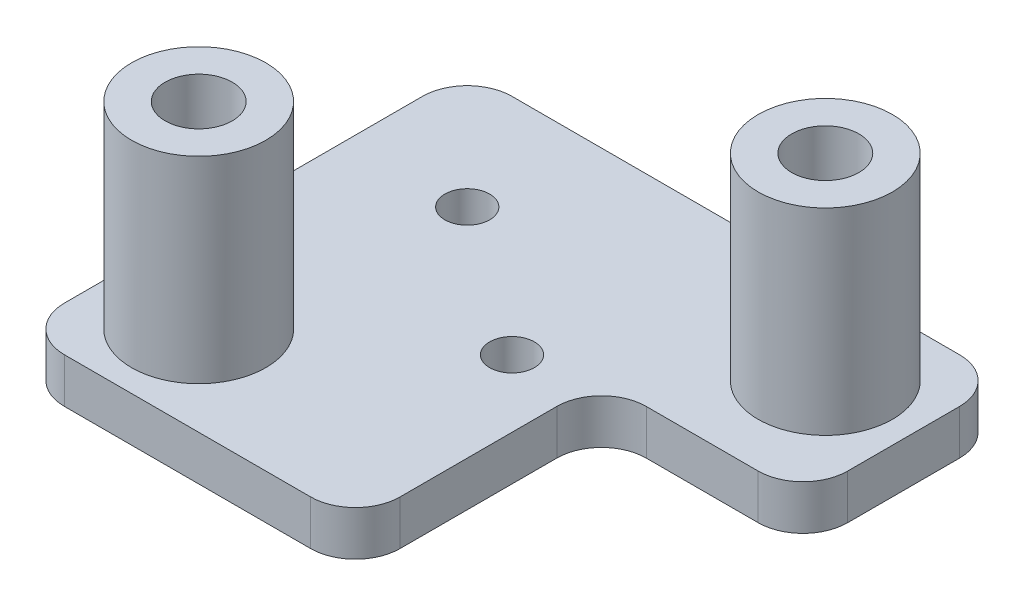
ISO-10303-21;
HEADER;
FILE_DESCRIPTION(('STEP AP214'),'2;1');
FILE_NAME('part.step','',(''),(''),'','','');
FILE_SCHEMA(('AUTOMOTIVE_DESIGN { 1 0 10303 214 1 1 1 1 }'));
ENDSEC;
DATA;
#1=APPLICATION_CONTEXT('core data for automotive mechanical design processes');
#2=APPLICATION_PROTOCOL_DEFINITION('international standard','automotive_design',2000,#1);
#3=PRODUCT_CONTEXT('',#1,'mechanical');
#4=PRODUCT('Part','Part','',(#3));
#5=PRODUCT_RELATED_PRODUCT_CATEGORY('part','',(#4));
#6=PRODUCT_DEFINITION_FORMATION('','',#4);
#7=PRODUCT_DEFINITION_CONTEXT('part definition',#1,'design');
#8=PRODUCT_DEFINITION('design','',#6,#7);
#9=PRODUCT_DEFINITION_SHAPE('','',#8);
#10=(LENGTH_UNIT() NAMED_UNIT(*) SI_UNIT(.MILLI.,.METRE.));
#11=(NAMED_UNIT(*) PLANE_ANGLE_UNIT() SI_UNIT($,.RADIAN.));
#12=(NAMED_UNIT(*) SI_UNIT($,.STERADIAN.) SOLID_ANGLE_UNIT());
#13=UNCERTAINTY_MEASURE_WITH_UNIT(LENGTH_MEASURE(1.E-05),#10,'distance_accuracy_value','');
#14=(GEOMETRIC_REPRESENTATION_CONTEXT(3) GLOBAL_UNCERTAINTY_ASSIGNED_CONTEXT((#13)) GLOBAL_UNIT_ASSIGNED_CONTEXT((#10,
#11,#12)) REPRESENTATION_CONTEXT('',''));
#15=CARTESIAN_POINT('',(0.,0.,0.));
#16=DIRECTION('',(0.,0.,1.));
#17=DIRECTION('',(1.,0.,0.));
#18=AXIS2_PLACEMENT_3D('',#15,#16,#17);
#19=CARTESIAN_POINT('',(-4.,5.4,3.));
#20=DIRECTION('',(0.,-1.,0.));
#21=DIRECTION('',(0.,0.,-1.));
#22=AXIS2_PLACEMENT_3D('',#19,#20,#21);
#23=CYLINDRICAL_SURFACE('',#22,1.5);
#24=CARTESIAN_POINT('',(-4.,5.4,3.));
#25=DIRECTION('',(0.,1.,0.));
#26=DIRECTION('',(0.,0.,1.));
#27=AXIS2_PLACEMENT_3D('',#24,#25,#26);
#28=CIRCLE('',#27,1.5);
#29=CARTESIAN_POINT('',(-4.,5.4,4.5));
#30=VERTEX_POINT('',#29);
#31=EDGE_CURVE('E11',#30,#30,#28,.T.);
#32=ORIENTED_EDGE('',*,*,#31,.F.);
#33=EDGE_LOOP('',(#32));
#34=FACE_BOUND('',#33,.T.);
#35=CARTESIAN_POINT('',(-4.,0.,3.));
#36=DIRECTION('',(0.,-1.,0.));
#37=DIRECTION('',(0.,0.,-1.));
#38=AXIS2_PLACEMENT_3D('',#35,#36,#37);
#39=CIRCLE('',#38,1.5);
#40=CARTESIAN_POINT('',(-4.,0.,1.5));
#41=VERTEX_POINT('',#40);
#42=EDGE_CURVE('E57',#41,#41,#39,.T.);
#43=ORIENTED_EDGE('',*,*,#42,.F.);
#44=EDGE_LOOP('',(#43));
#45=FACE_BOUND('',#44,.T.);
#46=ADVANCED_FACE('F47',(#34,#45),#23,.T.);
#47=CARTESIAN_POINT('',(-4.,5.4,3.));
#48=DIRECTION('',(0.,1.,0.));
#49=DIRECTION('',(0.,0.,1.));
#50=AXIS2_PLACEMENT_3D('',#47,#48,#49);
#51=PLANE('',#50);
#52=CARTESIAN_POINT('',(-4.,5.4,3.));
#53=DIRECTION('',(0.,1.,0.));
#54=DIRECTION('',(0.,0.,1.));
#55=AXIS2_PLACEMENT_3D('',#52,#53,#54);
#56=CIRCLE('',#55,0.75);
#57=CARTESIAN_POINT('',(-4.,5.4,3.75));
#58=VERTEX_POINT('',#57);
#59=EDGE_CURVE('E53',#58,#58,#56,.T.);
#60=ORIENTED_EDGE('',*,*,#59,.F.);
#61=EDGE_LOOP('',(#60));
#62=FACE_BOUND('',#61,.T.);
#63=ORIENTED_EDGE('',*,*,#31,.T.);
#64=EDGE_LOOP('',(#63));
#65=FACE_BOUND('',#64,.T.);
#66=ADVANCED_FACE('F76',(#62,#65),#51,.T.);
#67=CARTESIAN_POINT('',(-4.,-2.6,3.));
#68=DIRECTION('',(0.,1.,0.));
#69=DIRECTION('',(0.,0.,1.));
#70=AXIS2_PLACEMENT_3D('',#67,#68,#69);
#71=CYLINDRICAL_SURFACE('',#70,0.75);
#72=ORIENTED_EDGE('',*,*,#59,.T.);
#73=EDGE_LOOP('',(#72));
#74=FACE_BOUND('',#73,.T.);
#75=CARTESIAN_POINT('',(-4.,0.,3.));
#76=DIRECTION('',(0.,-1.,0.));
#77=DIRECTION('',(0.,0.,-1.));
#78=AXIS2_PLACEMENT_3D('',#75,#76,#77);
#79=CIRCLE('',#78,0.75);
#80=CARTESIAN_POINT('',(-4.,0.,2.25));
#81=VERTEX_POINT('',#80);
#82=EDGE_CURVE('E61',#81,#81,#79,.T.);
#83=ORIENTED_EDGE('',*,*,#82,.T.);
#84=EDGE_LOOP('',(#83));
#85=FACE_BOUND('',#84,.T.);
#86=ADVANCED_FACE('F67',(#74,#85),#71,.F.);
#87=CARTESIAN_POINT('',(-4.,0.,3.));
#88=DIRECTION('',(0.,-1.,0.));
#89=DIRECTION('',(0.,0.,-1.));
#90=AXIS2_PLACEMENT_3D('',#87,#88,#89);
#91=PLANE('',#90);
#92=ORIENTED_EDGE('',*,*,#42,.T.);
#93=EDGE_LOOP('',(#92));
#94=FACE_BOUND('',#93,.T.);
#95=ORIENTED_EDGE('',*,*,#82,.F.);
#96=EDGE_LOOP('',(#95));
#97=FACE_BOUND('',#96,.T.);
#98=ADVANCED_FACE('F69',(#94,#97),#91,.T.);
#99=CLOSED_SHELL('',(#46,#66,#86,#98));
#100=MANIFOLD_SOLID_BREP('B2',#99);
#101=CARTESIAN_POINT('',(4.,5.4,-3.));
#102=DIRECTION('',(0.,-1.,0.));
#103=DIRECTION('',(0.,0.,-1.));
#104=AXIS2_PLACEMENT_3D('',#101,#102,#103);
#105=CYLINDRICAL_SURFACE('',#104,1.5);
#106=CARTESIAN_POINT('',(4.,5.4,-3.));
#107=DIRECTION('',(0.,1.,0.));
#108=DIRECTION('',(0.,0.,1.));
#109=AXIS2_PLACEMENT_3D('',#106,#107,#108);
#110=CIRCLE('',#109,1.5);
#111=CARTESIAN_POINT('',(4.,5.4,-1.5));
#112=VERTEX_POINT('',#111);
#113=EDGE_CURVE('E46',#112,#112,#110,.T.);
#114=ORIENTED_EDGE('',*,*,#113,.F.);
#115=EDGE_LOOP('',(#114));
#116=FACE_BOUND('',#115,.T.);
#117=CARTESIAN_POINT('',(4.,0.,-3.));
#118=DIRECTION('',(0.,-1.,0.));
#119=DIRECTION('',(0.,0.,-1.));
#120=AXIS2_PLACEMENT_3D('',#117,#118,#119);
#121=CIRCLE('',#120,1.5);
#122=CARTESIAN_POINT('',(4.,0.,-4.5));
#123=VERTEX_POINT('',#122);
#124=EDGE_CURVE('E133',#123,#123,#121,.T.);
#125=ORIENTED_EDGE('',*,*,#124,.F.);
#126=EDGE_LOOP('',(#125));
#127=FACE_BOUND('',#126,.T.);
#128=ADVANCED_FACE('F123',(#116,#127),#105,.T.);
#129=CARTESIAN_POINT('',(4.,5.4,-3.));
#130=DIRECTION('',(0.,1.,0.));
#131=DIRECTION('',(0.,0.,1.));
#132=AXIS2_PLACEMENT_3D('',#129,#130,#131);
#133=PLANE('',#132);
#134=CARTESIAN_POINT('',(4.,5.4,-3.));
#135=DIRECTION('',(0.,1.,0.));
#136=DIRECTION('',(0.,0.,1.));
#137=AXIS2_PLACEMENT_3D('',#134,#135,#136);
#138=CIRCLE('',#137,0.75);
#139=CARTESIAN_POINT('',(4.,5.4,-2.25));
#140=VERTEX_POINT('',#139);
#141=EDGE_CURVE('E129',#140,#140,#138,.T.);
#142=ORIENTED_EDGE('',*,*,#141,.F.);
#143=EDGE_LOOP('',(#142));
#144=FACE_BOUND('',#143,.T.);
#145=ORIENTED_EDGE('',*,*,#113,.T.);
#146=EDGE_LOOP('',(#145));
#147=FACE_BOUND('',#146,.T.);
#148=ADVANCED_FACE('F152',(#144,#147),#133,.T.);
#149=CARTESIAN_POINT('',(4.,-2.6,-3.));
#150=DIRECTION('',(0.,1.,0.));
#151=DIRECTION('',(0.,0.,1.));
#152=AXIS2_PLACEMENT_3D('',#149,#150,#151);
#153=CYLINDRICAL_SURFACE('',#152,0.75);
#154=ORIENTED_EDGE('',*,*,#141,.T.);
#155=EDGE_LOOP('',(#154));
#156=FACE_BOUND('',#155,.T.);
#157=CARTESIAN_POINT('',(4.,0.,-3.));
#158=DIRECTION('',(0.,-1.,0.));
#159=DIRECTION('',(0.,0.,-1.));
#160=AXIS2_PLACEMENT_3D('',#157,#158,#159);
#161=CIRCLE('',#160,0.75);
#162=CARTESIAN_POINT('',(4.,0.,-3.75));
#163=VERTEX_POINT('',#162);
#164=EDGE_CURVE('E137',#163,#163,#161,.T.);
#165=ORIENTED_EDGE('',*,*,#164,.T.);
#166=EDGE_LOOP('',(#165));
#167=FACE_BOUND('',#166,.T.);
#168=ADVANCED_FACE('F143',(#156,#167),#153,.F.);
#169=CARTESIAN_POINT('',(4.,0.,-3.));
#170=DIRECTION('',(0.,-1.,0.));
#171=DIRECTION('',(0.,0.,-1.));
#172=AXIS2_PLACEMENT_3D('',#169,#170,#171);
#173=PLANE('',#172);
#174=ORIENTED_EDGE('',*,*,#124,.T.);
#175=EDGE_LOOP('',(#174));
#176=FACE_BOUND('',#175,.T.);
#177=ORIENTED_EDGE('',*,*,#164,.F.);
#178=EDGE_LOOP('',(#177));
#179=FACE_BOUND('',#178,.T.);
#180=ADVANCED_FACE('F145',(#176,#179),#173,.T.);
#181=CLOSED_SHELL('',(#128,#148,#168,#180));
#182=MANIFOLD_SOLID_BREP('B6',#181);
#183=CARTESIAN_POINT('',(0.,1.,0.));
#184=DIRECTION('',(0.,1.,0.));
#185=DIRECTION('',(0.,0.,1.));
#186=AXIS2_PLACEMENT_3D('',#183,#184,#185);
#187=PLANE('',#186);
#188=CARTESIAN_POINT('',(-3.36,1.,-2.36));
#189=DIRECTION('',(0.,1.,0.));
#190=DIRECTION('',(0.,0.,1.));
#191=AXIS2_PLACEMENT_3D('',#188,#189,#190);
#192=CIRCLE('',#191,0.5);
#193=CARTESIAN_POINT('',(-3.36,1.,-1.86));
#194=VERTEX_POINT('',#193);
#195=EDGE_CURVE('E490',#194,#194,#192,.T.);
#196=ORIENTED_EDGE('',*,*,#195,.F.);
#197=EDGE_LOOP('',(#196));
#198=FACE_BOUND('',#197,.T.);
#199=CARTESIAN_POINT('',(0.,1.,0.));
#200=DIRECTION('',(0.,1.,0.));
#201=DIRECTION('',(0.,0.,1.));
#202=AXIS2_PLACEMENT_3D('',#199,#200,#201);
#203=CIRCLE('',#202,0.5);
#204=CARTESIAN_POINT('',(0.,1.,0.5));
#205=VERTEX_POINT('',#204);
#206=EDGE_CURVE('E499',#205,#205,#203,.T.);
#207=ORIENTED_EDGE('',*,*,#206,.F.);
#208=EDGE_LOOP('',(#207));
#209=FACE_BOUND('',#208,.T.);
#210=CARTESIAN_POINT('',(4.,1.,-3.));
#211=DIRECTION('',(0.,1.,0.));
#212=DIRECTION('',(0.,0.,1.));
#213=AXIS2_PLACEMENT_3D('',#210,#211,#212);
#214=CIRCLE('',#213,1.5);
#215=CARTESIAN_POINT('',(4.,1.,-1.5));
#216=VERTEX_POINT('',#215);
#217=EDGE_CURVE('E388',#216,#216,#214,.T.);
#218=ORIENTED_EDGE('',*,*,#217,.F.);
#219=EDGE_LOOP('',(#218));
#220=FACE_BOUND('',#219,.T.);
#221=DIRECTION('',(1.,0.,0.));
#222=VECTOR('',#221,1.);
#223=CARTESIAN_POINT('',(1.5,1.,-0.500000000000002));
#224=LINE('',#223,#222);
#225=CARTESIAN_POINT('',(2.5,1.,-0.500000000000002));
#226=VERTEX_POINT('',#225);
#227=CARTESIAN_POINT('',(5.,1.,-0.500000000000002));
#228=VERTEX_POINT('',#227);
#229=EDGE_CURVE('E297',#226,#228,#224,.T.);
#230=ORIENTED_EDGE('',*,*,#229,.T.);
#231=CARTESIAN_POINT('',(5.,1.,-1.5));
#232=DIRECTION('',(0.,1.,0.));
#233=DIRECTION('',(0.,0.,1.));
#234=AXIS2_PLACEMENT_3D('',#231,#232,#233);
#235=CIRCLE('',#234,1.);
#236=CARTESIAN_POINT('',(6.,1.,-1.5));
#237=VERTEX_POINT('',#236);
#238=EDGE_CURVE('E343',#228,#237,#235,.T.);
#239=ORIENTED_EDGE('',*,*,#238,.T.);
#240=DIRECTION('',(0.,0.,-1.));
#241=VECTOR('',#240,1.);
#242=CARTESIAN_POINT('',(6.,1.,-5.));
#243=LINE('',#242,#241);
#244=CARTESIAN_POINT('',(6.,1.,-4.));
#245=VERTEX_POINT('',#244);
#246=EDGE_CURVE('E385',#237,#245,#243,.T.);
#247=ORIENTED_EDGE('',*,*,#246,.T.);
#248=CARTESIAN_POINT('',(5.,1.,-4.));
#249=DIRECTION('',(0.,1.,0.));
#250=DIRECTION('',(0.,0.,1.));
#251=AXIS2_PLACEMENT_3D('',#248,#249,#250);
#252=CIRCLE('',#251,1.);
#253=CARTESIAN_POINT('',(5.,1.,-5.));
#254=VERTEX_POINT('',#253);
#255=EDGE_CURVE('E212',#245,#254,#252,.T.);
#256=ORIENTED_EDGE('',*,*,#255,.T.);
#257=DIRECTION('',(-1.,0.,0.));
#258=VECTOR('',#257,1.);
#259=CARTESIAN_POINT('',(-6.,1.,-5.));
#260=LINE('',#259,#258);
#261=CARTESIAN_POINT('',(-5.,1.,-5.));
#262=VERTEX_POINT('',#261);
#263=EDGE_CURVE('E317',#254,#262,#260,.T.);
#264=ORIENTED_EDGE('',*,*,#263,.T.);
#265=CARTESIAN_POINT('',(-5.,1.,-4.));
#266=DIRECTION('',(0.,1.,0.));
#267=DIRECTION('',(0.,0.,1.));
#268=AXIS2_PLACEMENT_3D('',#265,#266,#267);
#269=CIRCLE('',#268,1.);
#270=CARTESIAN_POINT('',(-6.,1.,-4.));
#271=VERTEX_POINT('',#270);
#272=EDGE_CURVE('E336',#262,#271,#269,.T.);
#273=ORIENTED_EDGE('',*,*,#272,.T.);
#274=DIRECTION('',(0.,0.,1.));
#275=VECTOR('',#274,1.);
#276=CARTESIAN_POINT('',(-6.,1.,-5.));
#277=LINE('',#276,#275);
#278=CARTESIAN_POINT('',(-6.,1.,4.));
#279=VERTEX_POINT('',#278);
#280=EDGE_CURVE('E316',#271,#279,#277,.T.);
#281=ORIENTED_EDGE('',*,*,#280,.T.);
#282=CARTESIAN_POINT('',(-5.,1.,4.));
#283=DIRECTION('',(0.,1.,0.));
#284=DIRECTION('',(0.,0.,1.));
#285=AXIS2_PLACEMENT_3D('',#282,#283,#284);
#286=CIRCLE('',#285,1.);
#287=CARTESIAN_POINT('',(-5.,1.,5.));
#288=VERTEX_POINT('',#287);
#289=EDGE_CURVE('E339',#279,#288,#286,.T.);
#290=ORIENTED_EDGE('',*,*,#289,.T.);
#291=DIRECTION('',(1.,0.,0.));
#292=VECTOR('',#291,1.);
#293=CARTESIAN_POINT('',(-6.,1.,5.));
#294=LINE('',#293,#292);
#295=CARTESIAN_POINT('',(0.5,1.,5.));
#296=VERTEX_POINT('',#295);
#297=EDGE_CURVE('E373',#288,#296,#294,.T.);
#298=ORIENTED_EDGE('',*,*,#297,.T.);
#299=CARTESIAN_POINT('',(0.499999999999999,1.,4.));
#300=DIRECTION('',(0.,1.,0.));
#301=DIRECTION('',(0.,0.,1.));
#302=AXIS2_PLACEMENT_3D('',#299,#300,#301);
#303=CIRCLE('',#302,1.);
#304=CARTESIAN_POINT('',(1.5,1.,4.));
#305=VERTEX_POINT('',#304);
#306=EDGE_CURVE('E341',#296,#305,#303,.T.);
#307=ORIENTED_EDGE('',*,*,#306,.T.);
#308=DIRECTION('',(0.,0.,-1.));
#309=VECTOR('',#308,1.);
#310=CARTESIAN_POINT('',(1.5,1.,5.));
#311=LINE('',#310,#309);
#312=CARTESIAN_POINT('',(1.5,1.,0.499999999999998));
#313=VERTEX_POINT('',#312);
#314=EDGE_CURVE('E376',#305,#313,#311,.T.);
#315=ORIENTED_EDGE('',*,*,#314,.T.);
#316=CARTESIAN_POINT('',(2.5,1.,0.499999999999998));
#317=DIRECTION('',(0.,1.,0.));
#318=DIRECTION('',(0.,0.,1.));
#319=AXIS2_PLACEMENT_3D('',#316,#317,#318);
#320=CIRCLE('',#319,1.);
#321=EDGE_CURVE('E121',#313,#226,#320,.F.);
#322=ORIENTED_EDGE('',*,*,#321,.T.);
#323=EDGE_LOOP('',(#230,#239,#247,#256,#264,#273,#281,#290,#298,#307,#315,#322));
#324=FACE_BOUND('',#323,.T.);
#325=CARTESIAN_POINT('',(-4.,1.,3.));
#326=DIRECTION('',(0.,1.,0.));
#327=DIRECTION('',(0.,0.,1.));
#328=AXIS2_PLACEMENT_3D('',#325,#326,#327);
#329=CIRCLE('',#328,1.5);
#330=CARTESIAN_POINT('',(-4.,1.,4.5));
#331=VERTEX_POINT('',#330);
#332=EDGE_CURVE('E481',#331,#331,#329,.T.);
#333=ORIENTED_EDGE('',*,*,#332,.F.);
#334=EDGE_LOOP('',(#333));
#335=FACE_BOUND('',#334,.T.);
#336=ADVANCED_FACE('F190',(#198,#209,#220,#324,#335),#187,.T.);
#337=CARTESIAN_POINT('',(0.,0.,0.));
#338=DIRECTION('',(0.,1.,0.));
#339=DIRECTION('',(0.,0.,1.));
#340=AXIS2_PLACEMENT_3D('',#337,#338,#339);
#341=PLANE('',#340);
#342=CARTESIAN_POINT('',(-3.36,0.,-2.36));
#343=DIRECTION('',(0.,1.,0.));
#344=DIRECTION('',(0.,0.,1.));
#345=AXIS2_PLACEMENT_3D('',#342,#343,#344);
#346=CIRCLE('',#345,0.5);
#347=CARTESIAN_POINT('',(-3.36,0.,-1.86));
#348=VERTEX_POINT('',#347);
#349=EDGE_CURVE('E486',#348,#348,#346,.T.);
#350=ORIENTED_EDGE('',*,*,#349,.T.);
#351=EDGE_LOOP('',(#350));
#352=FACE_BOUND('',#351,.T.);
#353=CARTESIAN_POINT('',(0.,0.,0.));
#354=DIRECTION('',(0.,1.,0.));
#355=DIRECTION('',(0.,0.,1.));
#356=AXIS2_PLACEMENT_3D('',#353,#354,#355);
#357=CIRCLE('',#356,0.5);
#358=CARTESIAN_POINT('',(0.,0.,0.5));
#359=VERTEX_POINT('',#358);
#360=EDGE_CURVE('E502',#359,#359,#357,.T.);
#361=ORIENTED_EDGE('',*,*,#360,.T.);
#362=EDGE_LOOP('',(#361));
#363=FACE_BOUND('',#362,.T.);
#364=DIRECTION('',(0.,0.,-1.));
#365=VECTOR('',#364,1.);
#366=CARTESIAN_POINT('',(6.,0.,-5.));
#367=LINE('',#366,#365);
#368=CARTESIAN_POINT('',(6.,0.,-1.5));
#369=VERTEX_POINT('',#368);
#370=CARTESIAN_POINT('',(6.,0.,-4.));
#371=VERTEX_POINT('',#370);
#372=EDGE_CURVE('E305',#369,#371,#367,.T.);
#373=ORIENTED_EDGE('',*,*,#372,.F.);
#374=CARTESIAN_POINT('',(5.,0.,-1.5));
#375=DIRECTION('',(0.,1.,0.));
#376=DIRECTION('',(0.,0.,1.));
#377=AXIS2_PLACEMENT_3D('',#374,#375,#376);
#378=CIRCLE('',#377,1.);
#379=CARTESIAN_POINT('',(5.,0.,-0.500000000000002));
#380=VERTEX_POINT('',#379);
#381=EDGE_CURVE('E304',#369,#380,#378,.F.);
#382=ORIENTED_EDGE('',*,*,#381,.T.);
#383=DIRECTION('',(1.,0.,0.));
#384=VECTOR('',#383,1.);
#385=CARTESIAN_POINT('',(1.5,0.,-0.500000000000002));
#386=LINE('',#385,#384);
#387=CARTESIAN_POINT('',(2.5,0.,-0.500000000000002));
#388=VERTEX_POINT('',#387);
#389=EDGE_CURVE('E294',#388,#380,#386,.T.);
#390=ORIENTED_EDGE('',*,*,#389,.F.);
#391=CARTESIAN_POINT('',(2.5,0.,0.499999999999998));
#392=DIRECTION('',(0.,1.,0.));
#393=DIRECTION('',(0.,0.,1.));
#394=AXIS2_PLACEMENT_3D('',#391,#392,#393);
#395=CIRCLE('',#394,1.);
#396=CARTESIAN_POINT('',(1.5,0.,0.499999999999998));
#397=VERTEX_POINT('',#396);
#398=EDGE_CURVE('E198',#388,#397,#395,.T.);
#399=ORIENTED_EDGE('',*,*,#398,.T.);
#400=DIRECTION('',(0.,0.,-1.));
#401=VECTOR('',#400,1.);
#402=CARTESIAN_POINT('',(1.5,0.,5.));
#403=LINE('',#402,#401);
#404=CARTESIAN_POINT('',(1.5,0.,4.));
#405=VERTEX_POINT('',#404);
#406=EDGE_CURVE('E306',#405,#397,#403,.T.);
#407=ORIENTED_EDGE('',*,*,#406,.F.);
#408=CARTESIAN_POINT('',(0.499999999999999,0.,4.));
#409=DIRECTION('',(0.,1.,0.));
#410=DIRECTION('',(0.,0.,1.));
#411=AXIS2_PLACEMENT_3D('',#408,#409,#410);
#412=CIRCLE('',#411,1.);
#413=CARTESIAN_POINT('',(0.5,0.,5.));
#414=VERTEX_POINT('',#413);
#415=EDGE_CURVE('E333',#405,#414,#412,.F.);
#416=ORIENTED_EDGE('',*,*,#415,.T.);
#417=DIRECTION('',(1.,0.,0.));
#418=VECTOR('',#417,1.);
#419=CARTESIAN_POINT('',(-6.,0.,5.));
#420=LINE('',#419,#418);
#421=CARTESIAN_POINT('',(-5.,0.,5.));
#422=VERTEX_POINT('',#421);
#423=EDGE_CURVE('E311',#422,#414,#420,.T.);
#424=ORIENTED_EDGE('',*,*,#423,.F.);
#425=CARTESIAN_POINT('',(-5.,0.,4.));
#426=DIRECTION('',(0.,1.,0.));
#427=DIRECTION('',(0.,0.,1.));
#428=AXIS2_PLACEMENT_3D('',#425,#426,#427);
#429=CIRCLE('',#428,1.);
#430=CARTESIAN_POINT('',(-6.,0.,4.));
#431=VERTEX_POINT('',#430);
#432=EDGE_CURVE('E331',#422,#431,#429,.F.);
#433=ORIENTED_EDGE('',*,*,#432,.T.);
#434=DIRECTION('',(0.,0.,1.));
#435=VECTOR('',#434,1.);
#436=CARTESIAN_POINT('',(-6.,0.,-5.));
#437=LINE('',#436,#435);
#438=CARTESIAN_POINT('',(-6.,0.,-4.));
#439=VERTEX_POINT('',#438);
#440=EDGE_CURVE('E363',#439,#431,#437,.T.);
#441=ORIENTED_EDGE('',*,*,#440,.F.);
#442=CARTESIAN_POINT('',(-5.,0.,-4.));
#443=DIRECTION('',(0.,1.,0.));
#444=DIRECTION('',(0.,0.,1.));
#445=AXIS2_PLACEMENT_3D('',#442,#443,#444);
#446=CIRCLE('',#445,1.);
#447=CARTESIAN_POINT('',(-5.,0.,-5.));
#448=VERTEX_POINT('',#447);
#449=EDGE_CURVE('E327',#439,#448,#446,.F.);
#450=ORIENTED_EDGE('',*,*,#449,.T.);
#451=DIRECTION('',(-1.,0.,0.));
#452=VECTOR('',#451,1.);
#453=CARTESIAN_POINT('',(-6.,0.,-5.));
#454=LINE('',#453,#452);
#455=CARTESIAN_POINT('',(5.,0.,-5.));
#456=VERTEX_POINT('',#455);
#457=EDGE_CURVE('E309',#456,#448,#454,.T.);
#458=ORIENTED_EDGE('',*,*,#457,.F.);
#459=CARTESIAN_POINT('',(5.,0.,-4.));
#460=DIRECTION('',(0.,1.,0.));
#461=DIRECTION('',(0.,0.,1.));
#462=AXIS2_PLACEMENT_3D('',#459,#460,#461);
#463=CIRCLE('',#462,1.);
#464=EDGE_CURVE('E329',#456,#371,#463,.F.);
#465=ORIENTED_EDGE('',*,*,#464,.T.);
#466=EDGE_LOOP('',(#373,#382,#390,#399,#407,#416,#424,#433,#441,#450,#458,#465));
#467=FACE_BOUND('',#466,.T.);
#468=CARTESIAN_POINT('',(4.,0.,-3.));
#469=DIRECTION('',(0.,1.,0.));
#470=DIRECTION('',(0.,0.,1.));
#471=AXIS2_PLACEMENT_3D('',#468,#469,#470);
#472=CIRCLE('',#471,1.5);
#473=CARTESIAN_POINT('',(4.,0.,-1.5));
#474=VERTEX_POINT('',#473);
#475=EDGE_CURVE('E379',#474,#474,#472,.T.);
#476=ORIENTED_EDGE('',*,*,#475,.T.);
#477=EDGE_LOOP('',(#476));
#478=FACE_BOUND('',#477,.T.);
#479=CARTESIAN_POINT('',(-4.,0.,3.));
#480=DIRECTION('',(0.,1.,0.));
#481=DIRECTION('',(0.,0.,1.));
#482=AXIS2_PLACEMENT_3D('',#479,#480,#481);
#483=CIRCLE('',#482,1.5);
#484=CARTESIAN_POINT('',(-4.,0.,4.5));
#485=VERTEX_POINT('',#484);
#486=EDGE_CURVE('E484',#485,#485,#483,.T.);
#487=ORIENTED_EDGE('',*,*,#486,.T.);
#488=EDGE_LOOP('',(#487));
#489=FACE_BOUND('',#488,.T.);
#490=ADVANCED_FACE('F302',(#352,#363,#467,#478,#489),#341,.F.);
#491=CARTESIAN_POINT('',(-6.,1.,-5.));
#492=DIRECTION('',(1.,0.,0.));
#493=DIRECTION('',(0.,0.,-1.));
#494=AXIS2_PLACEMENT_3D('',#491,#492,#493);
#495=PLANE('',#494);
#496=ORIENTED_EDGE('',*,*,#440,.T.);
#497=DIRECTION('',(0.,-1.,0.));
#498=VECTOR('',#497,1.);
#499=CARTESIAN_POINT('',(-6.,1.,4.));
#500=LINE('',#499,#498);
#501=EDGE_CURVE('E353',#431,#279,#500,.F.);
#502=ORIENTED_EDGE('',*,*,#501,.T.);
#503=ORIENTED_EDGE('',*,*,#280,.F.);
#504=DIRECTION('',(0.,-1.,0.));
#505=VECTOR('',#504,1.);
#506=CARTESIAN_POINT('',(-6.,1.,-4.));
#507=LINE('',#506,#505);
#508=EDGE_CURVE('E350',#271,#439,#507,.T.);
#509=ORIENTED_EDGE('',*,*,#508,.T.);
#510=EDGE_LOOP('',(#496,#502,#503,#509));
#511=FACE_BOUND('',#510,.T.);
#512=ADVANCED_FACE('F369',(#511),#495,.F.);
#513=CARTESIAN_POINT('',(-6.,1.,5.));
#514=DIRECTION('',(0.,0.,-1.));
#515=DIRECTION('',(-1.,0.,0.));
#516=AXIS2_PLACEMENT_3D('',#513,#514,#515);
#517=PLANE('',#516);
#518=ORIENTED_EDGE('',*,*,#423,.T.);
#519=DIRECTION('',(0.,-1.,0.));
#520=VECTOR('',#519,1.);
#521=CARTESIAN_POINT('',(0.5,1.,5.));
#522=LINE('',#521,#520);
#523=EDGE_CURVE('E348',#414,#296,#522,.F.);
#524=ORIENTED_EDGE('',*,*,#523,.T.);
#525=ORIENTED_EDGE('',*,*,#297,.F.);
#526=DIRECTION('',(0.,-1.,0.));
#527=VECTOR('',#526,1.);
#528=CARTESIAN_POINT('',(-5.,1.,5.));
#529=LINE('',#528,#527);
#530=EDGE_CURVE('E345',#288,#422,#529,.T.);
#531=ORIENTED_EDGE('',*,*,#530,.T.);
#532=EDGE_LOOP('',(#518,#524,#525,#531));
#533=FACE_BOUND('',#532,.T.);
#534=ADVANCED_FACE('F393',(#533),#517,.F.);
#535=CARTESIAN_POINT('',(1.5,1.,5.));
#536=DIRECTION('',(-1.,0.,0.));
#537=DIRECTION('',(0.,0.,1.));
#538=AXIS2_PLACEMENT_3D('',#535,#536,#537);
#539=PLANE('',#538);
#540=ORIENTED_EDGE('',*,*,#406,.T.);
#541=DIRECTION('',(0.,-1.,0.));
#542=VECTOR('',#541,1.);
#543=CARTESIAN_POINT('',(1.5,1.,0.499999999999998));
#544=LINE('',#543,#542);
#545=EDGE_CURVE('E284',#397,#313,#544,.F.);
#546=ORIENTED_EDGE('',*,*,#545,.T.);
#547=ORIENTED_EDGE('',*,*,#314,.F.);
#548=DIRECTION('',(0.,-1.,0.));
#549=VECTOR('',#548,1.);
#550=CARTESIAN_POINT('',(1.5,1.,4.));
#551=LINE('',#550,#549);
#552=EDGE_CURVE('E298',#305,#405,#551,.T.);
#553=ORIENTED_EDGE('',*,*,#552,.T.);
#554=EDGE_LOOP('',(#540,#546,#547,#553));
#555=FACE_BOUND('',#554,.T.);
#556=ADVANCED_FACE('F403',(#555),#539,.F.);
#557=CARTESIAN_POINT('',(1.5,1.,-0.500000000000002));
#558=DIRECTION('',(0.,0.,-1.));
#559=DIRECTION('',(-1.,0.,0.));
#560=AXIS2_PLACEMENT_3D('',#557,#558,#559);
#561=PLANE('',#560);
#562=ORIENTED_EDGE('',*,*,#229,.F.);
#563=DIRECTION('',(0.,-1.,0.));
#564=VECTOR('',#563,1.);
#565=CARTESIAN_POINT('',(2.5,0.,-0.500000000000002));
#566=LINE('',#565,#564);
#567=EDGE_CURVE('E283',#226,#388,#566,.T.);
#568=ORIENTED_EDGE('',*,*,#567,.T.);
#569=ORIENTED_EDGE('',*,*,#389,.T.);
#570=DIRECTION('',(0.,-1.,0.));
#571=VECTOR('',#570,1.);
#572=CARTESIAN_POINT('',(5.,1.,-0.500000000000002));
#573=LINE('',#572,#571);
#574=EDGE_CURVE('E299',#380,#228,#573,.F.);
#575=ORIENTED_EDGE('',*,*,#574,.T.);
#576=EDGE_LOOP('',(#562,#568,#569,#575));
#577=FACE_BOUND('',#576,.T.);
#578=ADVANCED_FACE('F293',(#577),#561,.F.);
#579=CARTESIAN_POINT('',(6.,1.,-5.));
#580=DIRECTION('',(-1.,0.,0.));
#581=DIRECTION('',(0.,0.,1.));
#582=AXIS2_PLACEMENT_3D('',#579,#580,#581);
#583=PLANE('',#582);
#584=ORIENTED_EDGE('',*,*,#246,.F.);
#585=DIRECTION('',(0.,-1.,0.));
#586=VECTOR('',#585,1.);
#587=CARTESIAN_POINT('',(6.,1.,-1.5));
#588=LINE('',#587,#586);
#589=EDGE_CURVE('E324',#237,#369,#588,.T.);
#590=ORIENTED_EDGE('',*,*,#589,.T.);
#591=ORIENTED_EDGE('',*,*,#372,.T.);
#592=DIRECTION('',(0.,-1.,0.));
#593=VECTOR('',#592,1.);
#594=CARTESIAN_POINT('',(6.,1.,-4.));
#595=LINE('',#594,#593);
#596=EDGE_CURVE('E322',#371,#245,#595,.F.);
#597=ORIENTED_EDGE('',*,*,#596,.T.);
#598=EDGE_LOOP('',(#584,#590,#591,#597));
#599=FACE_BOUND('',#598,.T.);
#600=ADVANCED_FACE('F410',(#599),#583,.F.);
#601=CARTESIAN_POINT('',(-6.,1.,-5.));
#602=DIRECTION('',(0.,0.,1.));
#603=DIRECTION('',(1.,0.,0.));
#604=AXIS2_PLACEMENT_3D('',#601,#602,#603);
#605=PLANE('',#604);
#606=ORIENTED_EDGE('',*,*,#263,.F.);
#607=DIRECTION('',(0.,-1.,0.));
#608=VECTOR('',#607,1.);
#609=CARTESIAN_POINT('',(5.,1.,-5.));
#610=LINE('',#609,#608);
#611=EDGE_CURVE('E289',#254,#456,#610,.T.);
#612=ORIENTED_EDGE('',*,*,#611,.T.);
#613=ORIENTED_EDGE('',*,*,#457,.T.);
#614=DIRECTION('',(0.,-1.,0.));
#615=VECTOR('',#614,1.);
#616=CARTESIAN_POINT('',(-5.,1.,-5.));
#617=LINE('',#616,#615);
#618=EDGE_CURVE('E205',#448,#262,#617,.F.);
#619=ORIENTED_EDGE('',*,*,#618,.T.);
#620=EDGE_LOOP('',(#606,#612,#613,#619));
#621=FACE_BOUND('',#620,.T.);
#622=ADVANCED_FACE('F359',(#621),#605,.F.);
#623=CARTESIAN_POINT('',(4.,1.,-3.));
#624=DIRECTION('',(0.,-1.,0.));
#625=DIRECTION('',(0.,0.,-1.));
#626=AXIS2_PLACEMENT_3D('',#623,#624,#625);
#627=CYLINDRICAL_SURFACE('',#626,1.5);
#628=ORIENTED_EDGE('',*,*,#217,.T.);
#629=EDGE_LOOP('',(#628));
#630=FACE_BOUND('',#629,.T.);
#631=ORIENTED_EDGE('',*,*,#475,.F.);
#632=EDGE_LOOP('',(#631));
#633=FACE_BOUND('',#632,.T.);
#634=ADVANCED_FACE('F424',(#630,#633),#627,.F.);
#635=CARTESIAN_POINT('',(-4.,1.,3.));
#636=DIRECTION('',(0.,-1.,0.));
#637=DIRECTION('',(0.,0.,-1.));
#638=AXIS2_PLACEMENT_3D('',#635,#636,#637);
#639=CYLINDRICAL_SURFACE('',#638,1.5);
#640=ORIENTED_EDGE('',*,*,#332,.T.);
#641=EDGE_LOOP('',(#640));
#642=FACE_BOUND('',#641,.T.);
#643=ORIENTED_EDGE('',*,*,#486,.F.);
#644=EDGE_LOOP('',(#643));
#645=FACE_BOUND('',#644,.T.);
#646=ADVANCED_FACE('F447',(#642,#645),#639,.F.);
#647=CARTESIAN_POINT('',(2.5,1.,0.499999999999998));
#648=DIRECTION('',(0.,1.,0.));
#649=DIRECTION('',(0.,0.,1.));
#650=AXIS2_PLACEMENT_3D('',#647,#648,#649);
#651=CYLINDRICAL_SURFACE('',#650,1.);
#652=ORIENTED_EDGE('',*,*,#321,.F.);
#653=ORIENTED_EDGE('',*,*,#545,.F.);
#654=ORIENTED_EDGE('',*,*,#398,.F.);
#655=ORIENTED_EDGE('',*,*,#567,.F.);
#656=EDGE_LOOP('',(#652,#653,#654,#655));
#657=FACE_BOUND('',#656,.T.);
#658=ADVANCED_FACE('F282',(#657),#651,.F.);
#659=CARTESIAN_POINT('',(5.,1.,-1.5));
#660=DIRECTION('',(0.,-1.,0.));
#661=DIRECTION('',(0.,0.,-1.));
#662=AXIS2_PLACEMENT_3D('',#659,#660,#661);
#663=CYLINDRICAL_SURFACE('',#662,1.);
#664=ORIENTED_EDGE('',*,*,#238,.F.);
#665=ORIENTED_EDGE('',*,*,#574,.F.);
#666=ORIENTED_EDGE('',*,*,#381,.F.);
#667=ORIENTED_EDGE('',*,*,#589,.F.);
#668=EDGE_LOOP('',(#664,#665,#666,#667));
#669=FACE_BOUND('',#668,.T.);
#670=ADVANCED_FACE('F438',(#669),#663,.T.);
#671=CARTESIAN_POINT('',(0.499999999999999,1.,4.));
#672=DIRECTION('',(0.,-1.,0.));
#673=DIRECTION('',(0.,0.,-1.));
#674=AXIS2_PLACEMENT_3D('',#671,#672,#673);
#675=CYLINDRICAL_SURFACE('',#674,1.);
#676=ORIENTED_EDGE('',*,*,#306,.F.);
#677=ORIENTED_EDGE('',*,*,#523,.F.);
#678=ORIENTED_EDGE('',*,*,#415,.F.);
#679=ORIENTED_EDGE('',*,*,#552,.F.);
#680=EDGE_LOOP('',(#676,#677,#678,#679));
#681=FACE_BOUND('',#680,.T.);
#682=ADVANCED_FACE('F398',(#681),#675,.T.);
#683=CARTESIAN_POINT('',(-5.,1.,4.));
#684=DIRECTION('',(0.,-1.,0.));
#685=DIRECTION('',(0.,0.,-1.));
#686=AXIS2_PLACEMENT_3D('',#683,#684,#685);
#687=CYLINDRICAL_SURFACE('',#686,1.);
#688=ORIENTED_EDGE('',*,*,#289,.F.);
#689=ORIENTED_EDGE('',*,*,#501,.F.);
#690=ORIENTED_EDGE('',*,*,#432,.F.);
#691=ORIENTED_EDGE('',*,*,#530,.F.);
#692=EDGE_LOOP('',(#688,#689,#690,#691));
#693=FACE_BOUND('',#692,.T.);
#694=ADVANCED_FACE('F445',(#693),#687,.T.);
#695=CARTESIAN_POINT('',(5.,1.,-4.));
#696=DIRECTION('',(0.,-1.,0.));
#697=DIRECTION('',(0.,0.,-1.));
#698=AXIS2_PLACEMENT_3D('',#695,#696,#697);
#699=CYLINDRICAL_SURFACE('',#698,1.);
#700=ORIENTED_EDGE('',*,*,#255,.F.);
#701=ORIENTED_EDGE('',*,*,#596,.F.);
#702=ORIENTED_EDGE('',*,*,#464,.F.);
#703=ORIENTED_EDGE('',*,*,#611,.F.);
#704=EDGE_LOOP('',(#700,#701,#702,#703));
#705=FACE_BOUND('',#704,.T.);
#706=ADVANCED_FACE('F452',(#705),#699,.T.);
#707=CARTESIAN_POINT('',(-5.,1.,-4.));
#708=DIRECTION('',(0.,-1.,0.));
#709=DIRECTION('',(0.,0.,-1.));
#710=AXIS2_PLACEMENT_3D('',#707,#708,#709);
#711=CYLINDRICAL_SURFACE('',#710,1.);
#712=ORIENTED_EDGE('',*,*,#272,.F.);
#713=ORIENTED_EDGE('',*,*,#618,.F.);
#714=ORIENTED_EDGE('',*,*,#449,.F.);
#715=ORIENTED_EDGE('',*,*,#508,.F.);
#716=EDGE_LOOP('',(#712,#713,#714,#715));
#717=FACE_BOUND('',#716,.T.);
#718=ADVANCED_FACE('F192',(#717),#711,.T.);
#719=CARTESIAN_POINT('',(0.,0.,0.));
#720=DIRECTION('',(0.,1.,0.));
#721=DIRECTION('',(0.,0.,1.));
#722=AXIS2_PLACEMENT_3D('',#719,#720,#721);
#723=CYLINDRICAL_SURFACE('',#722,0.5);
#724=ORIENTED_EDGE('',*,*,#360,.F.);
#725=EDGE_LOOP('',(#724));
#726=FACE_BOUND('',#725,.T.);
#727=ORIENTED_EDGE('',*,*,#206,.T.);
#728=EDGE_LOOP('',(#727));
#729=FACE_BOUND('',#728,.T.);
#730=ADVANCED_FACE('F458',(#726,#729),#723,.F.);
#731=CARTESIAN_POINT('',(-3.36,0.,-2.36));
#732=DIRECTION('',(0.,1.,0.));
#733=DIRECTION('',(0.,0.,1.));
#734=AXIS2_PLACEMENT_3D('',#731,#732,#733);
#735=CYLINDRICAL_SURFACE('',#734,0.5);
#736=ORIENTED_EDGE('',*,*,#349,.F.);
#737=EDGE_LOOP('',(#736));
#738=FACE_BOUND('',#737,.T.);
#739=ORIENTED_EDGE('',*,*,#195,.T.);
#740=EDGE_LOOP('',(#739));
#741=FACE_BOUND('',#740,.T.);
#742=ADVANCED_FACE('F462',(#738,#741),#735,.F.);
#743=CLOSED_SHELL('',(#336,#490,#512,#534,#556,#578,#600,#622,#634,#646,#658,#670,#682,#694,
#706,#718,#730,#742));
#744=MANIFOLD_SOLID_BREP('B41',#743);
#745=ADVANCED_BREP_SHAPE_REPRESENTATION('',(#18,#100,#182,#744),#14);
#746=SHAPE_DEFINITION_REPRESENTATION(#9,#745);
ENDSEC;
END-ISO-10303-21;
